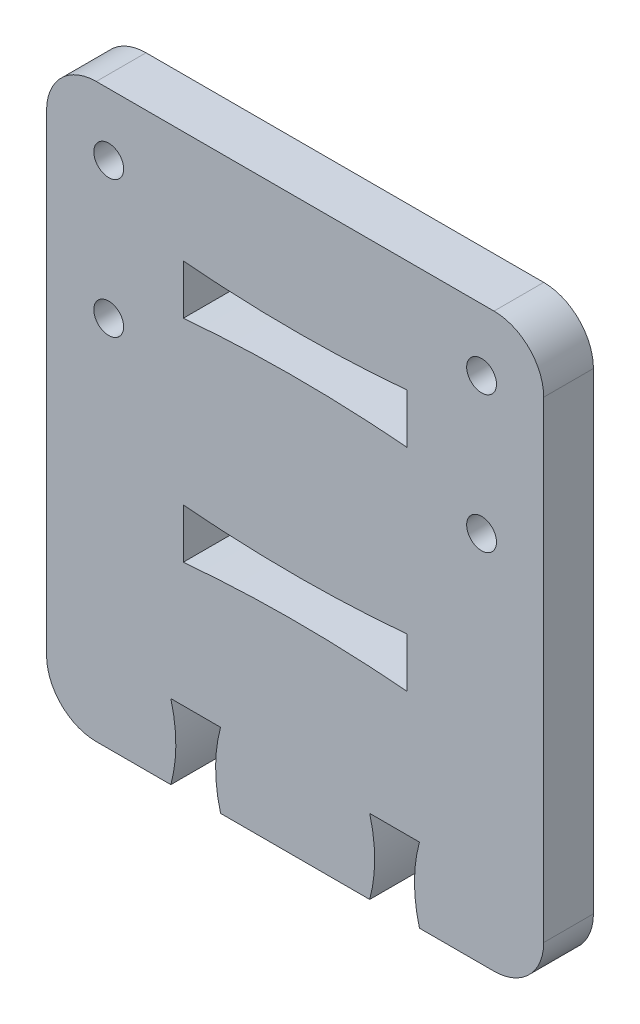
ISO-10303-21;
HEADER;
FILE_DESCRIPTION(('STEP AP214'),'2;1');
FILE_NAME('part.step','',(''),(''),'','','');
FILE_SCHEMA(('AUTOMOTIVE_DESIGN { 1 0 10303 214 1 1 1 1 }'));
ENDSEC;
DATA;
#1=APPLICATION_CONTEXT('core data for automotive mechanical design processes');
#2=APPLICATION_PROTOCOL_DEFINITION('international standard','automotive_design',2000,#1);
#3=PRODUCT_CONTEXT('',#1,'mechanical');
#4=PRODUCT('Part','Part','',(#3));
#5=PRODUCT_RELATED_PRODUCT_CATEGORY('part','',(#4));
#6=PRODUCT_DEFINITION_FORMATION('','',#4);
#7=PRODUCT_DEFINITION_CONTEXT('part definition',#1,'design');
#8=PRODUCT_DEFINITION('design','',#6,#7);
#9=PRODUCT_DEFINITION_SHAPE('','',#8);
#10=(LENGTH_UNIT() NAMED_UNIT(*) SI_UNIT(.MILLI.,.METRE.));
#11=(NAMED_UNIT(*) PLANE_ANGLE_UNIT() SI_UNIT($,.RADIAN.));
#12=(NAMED_UNIT(*) SI_UNIT($,.STERADIAN.) SOLID_ANGLE_UNIT());
#13=UNCERTAINTY_MEASURE_WITH_UNIT(LENGTH_MEASURE(1.E-05),#10,'distance_accuracy_value','');
#14=(GEOMETRIC_REPRESENTATION_CONTEXT(3) GLOBAL_UNCERTAINTY_ASSIGNED_CONTEXT((#13)) GLOBAL_UNIT_ASSIGNED_CONTEXT((#10,
#11,#12)) REPRESENTATION_CONTEXT('',''));
#15=CARTESIAN_POINT('',(0.,0.,0.));
#16=DIRECTION('',(0.,0.,1.));
#17=DIRECTION('',(1.,0.,0.));
#18=AXIS2_PLACEMENT_3D('',#15,#16,#17);
#19=CARTESIAN_POINT('',(14.8,1.5,2.));
#20=DIRECTION('',(0.,0.,-1.));
#21=DIRECTION('',(-1.,0.,0.));
#22=AXIS2_PLACEMENT_3D('',#19,#20,#21);
#23=PLANE('',#22);
#24=CARTESIAN_POINT('',(2.5,15.,2.));
#25=DIRECTION('',(0.,0.,1.));
#26=DIRECTION('',(1.,0.,0.));
#27=AXIS2_PLACEMENT_3D('',#24,#25,#26);
#28=CIRCLE('',#27,0.6);
#29=CARTESIAN_POINT('',(3.1,15.,2.));
#30=VERTEX_POINT('',#29);
#31=EDGE_CURVE('E811',#30,#30,#28,.T.);
#32=ORIENTED_EDGE('',*,*,#31,.F.);
#33=EDGE_LOOP('',(#32));
#34=FACE_BOUND('',#33,.T.);
#35=CARTESIAN_POINT('',(14.5,18.5,2.));
#36=CARTESIAN_POINT('',(10.,18.1,2.));
#37=CARTESIAN_POINT('',(5.5,18.5,2.));
#38=B_SPLINE_CURVE_WITH_KNOTS('',2,(#35,#36,#37),.UNSPECIFIED.,.F.,.F.,(3,3),(0.,1.),.UNSPECIFIED.);
#39=CARTESIAN_POINT('',(14.5,18.5,2.));
#40=VERTEX_POINT('',#39);
#41=CARTESIAN_POINT('',(5.5,18.5,2.));
#42=VERTEX_POINT('',#41);
#43=EDGE_CURVE('E294',#40,#42,#38,.T.);
#44=ORIENTED_EDGE('',*,*,#43,.F.);
#45=DIRECTION('',(0.,1.,0.));
#46=VECTOR('',#45,1.);
#47=CARTESIAN_POINT('',(14.5,16.5,2.));
#48=LINE('',#47,#46);
#49=CARTESIAN_POINT('',(14.5,16.5,2.));
#50=VERTEX_POINT('',#49);
#51=EDGE_CURVE('E265',#50,#40,#48,.T.);
#52=ORIENTED_EDGE('',*,*,#51,.F.);
#53=CARTESIAN_POINT('',(5.5,16.5,2.));
#54=CARTESIAN_POINT('',(10.,16.9,2.));
#55=CARTESIAN_POINT('',(14.5,16.5,2.));
#56=B_SPLINE_CURVE_WITH_KNOTS('',2,(#53,#54,#55),.UNSPECIFIED.,.F.,.F.,(3,3),(0.,1.),.UNSPECIFIED.);
#57=CARTESIAN_POINT('',(5.5,16.5,2.));
#58=VERTEX_POINT('',#57);
#59=EDGE_CURVE('E258',#58,#50,#56,.T.);
#60=ORIENTED_EDGE('',*,*,#59,.F.);
#61=DIRECTION('',(0.,-1.,0.));
#62=VECTOR('',#61,1.);
#63=CARTESIAN_POINT('',(5.5,16.5,2.));
#64=LINE('',#63,#62);
#65=EDGE_CURVE('E266',#42,#58,#64,.T.);
#66=ORIENTED_EDGE('',*,*,#65,.F.);
#67=EDGE_LOOP('',(#44,#52,#60,#66));
#68=FACE_BOUND('',#67,.T.);
#69=CARTESIAN_POINT('',(17.5,20.5,2.));
#70=DIRECTION('',(0.,0.,1.));
#71=DIRECTION('',(-1.,0.,0.));
#72=AXIS2_PLACEMENT_3D('',#69,#70,#71);
#73=CIRCLE('',#72,0.600000000000003);
#74=CARTESIAN_POINT('',(16.9,20.5,2.));
#75=VERTEX_POINT('',#74);
#76=EDGE_CURVE('E311',#75,#75,#73,.T.);
#77=ORIENTED_EDGE('',*,*,#76,.F.);
#78=EDGE_LOOP('',(#77));
#79=FACE_BOUND('',#78,.T.);
#80=DIRECTION('',(0.,-1.,0.));
#81=VECTOR('',#80,1.);
#82=CARTESIAN_POINT('',(0.,0.,2.));
#83=LINE('',#82,#81);
#84=CARTESIAN_POINT('',(0.,21.,2.));
#85=VERTEX_POINT('',#84);
#86=CARTESIAN_POINT('',(0.,2.,2.));
#87=VERTEX_POINT('',#86);
#88=EDGE_CURVE('E513',#85,#87,#83,.T.);
#89=ORIENTED_EDGE('',*,*,#88,.T.);
#90=CARTESIAN_POINT('',(2.,2.,2.));
#91=DIRECTION('',(0.,0.,-1.));
#92=DIRECTION('',(-1.,0.,0.));
#93=AXIS2_PLACEMENT_3D('',#90,#91,#92);
#94=CIRCLE('',#93,2.);
#95=CARTESIAN_POINT('',(2.,0.,2.));
#96=VERTEX_POINT('',#95);
#97=EDGE_CURVE('E482',#87,#96,#94,.F.);
#98=ORIENTED_EDGE('',*,*,#97,.T.);
#99=DIRECTION('',(1.,0.,0.));
#100=VECTOR('',#99,1.);
#101=CARTESIAN_POINT('',(5.,0.,2.));
#102=LINE('',#101,#100);
#103=CARTESIAN_POINT('',(5.,0.,2.));
#104=VERTEX_POINT('',#103);
#105=EDGE_CURVE('E515',#96,#104,#102,.T.);
#106=ORIENTED_EDGE('',*,*,#105,.T.);
#107=CARTESIAN_POINT('',(5.,0.,2.));
#108=CARTESIAN_POINT('',(5.4,1.5,2.));
#109=CARTESIAN_POINT('',(5.,3.,2.));
#110=B_SPLINE_CURVE_WITH_KNOTS('',2,(#107,#108,#109),.UNSPECIFIED.,.F.,.F.,(3,3),(0.,1.),.UNSPECIFIED.);
#111=CARTESIAN_POINT('',(5.,3.,2.));
#112=VERTEX_POINT('',#111);
#113=EDGE_CURVE('E519',#104,#112,#110,.T.);
#114=ORIENTED_EDGE('',*,*,#113,.T.);
#115=DIRECTION('',(1.,0.,0.));
#116=VECTOR('',#115,1.);
#117=CARTESIAN_POINT('',(5.,3.,2.));
#118=LINE('',#117,#116);
#119=CARTESIAN_POINT('',(7.,3.,2.));
#120=VERTEX_POINT('',#119);
#121=EDGE_CURVE('E524',#112,#120,#118,.T.);
#122=ORIENTED_EDGE('',*,*,#121,.T.);
#123=CARTESIAN_POINT('',(7.,3.,2.));
#124=CARTESIAN_POINT('',(6.6,1.5,2.));
#125=CARTESIAN_POINT('',(7.,0.,2.));
#126=B_SPLINE_CURVE_WITH_KNOTS('',2,(#123,#124,#125),.UNSPECIFIED.,.F.,.F.,(3,3),(0.,1.),.UNSPECIFIED.);
#127=CARTESIAN_POINT('',(7.,0.,2.));
#128=VERTEX_POINT('',#127);
#129=EDGE_CURVE('E755',#120,#128,#126,.T.);
#130=ORIENTED_EDGE('',*,*,#129,.T.);
#131=DIRECTION('',(1.,0.,0.));
#132=VECTOR('',#131,1.);
#133=CARTESIAN_POINT('',(13.,0.,2.));
#134=LINE('',#133,#132);
#135=CARTESIAN_POINT('',(13.,0.,2.));
#136=VERTEX_POINT('',#135);
#137=EDGE_CURVE('E385',#128,#136,#134,.T.);
#138=ORIENTED_EDGE('',*,*,#137,.T.);
#139=CARTESIAN_POINT('',(13.,0.,2.));
#140=CARTESIAN_POINT('',(13.4,1.5,2.));
#141=CARTESIAN_POINT('',(13.,3.,2.));
#142=B_SPLINE_CURVE_WITH_KNOTS('',2,(#139,#140,#141),.UNSPECIFIED.,.F.,.F.,(3,3),(0.,1.),.UNSPECIFIED.);
#143=CARTESIAN_POINT('',(13.,3.,2.));
#144=VERTEX_POINT('',#143);
#145=EDGE_CURVE('E378',#136,#144,#142,.T.);
#146=ORIENTED_EDGE('',*,*,#145,.T.);
#147=DIRECTION('',(1.,0.,0.));
#148=VECTOR('',#147,1.);
#149=CARTESIAN_POINT('',(15.,3.,2.));
#150=LINE('',#149,#148);
#151=CARTESIAN_POINT('',(15.,3.,2.));
#152=VERTEX_POINT('',#151);
#153=EDGE_CURVE('E384',#144,#152,#150,.T.);
#154=ORIENTED_EDGE('',*,*,#153,.T.);
#155=CARTESIAN_POINT('',(15.,3.,2.));
#156=CARTESIAN_POINT('',(14.6,1.5,2.));
#157=CARTESIAN_POINT('',(15.,0.,2.));
#158=B_SPLINE_CURVE_WITH_KNOTS('',2,(#155,#156,#157),.UNSPECIFIED.,.F.,.F.,(3,3),(0.,1.),.UNSPECIFIED.);
#159=CARTESIAN_POINT('',(15.,0.,2.));
#160=VERTEX_POINT('',#159);
#161=EDGE_CURVE('E317',#152,#160,#158,.T.);
#162=ORIENTED_EDGE('',*,*,#161,.T.);
#163=DIRECTION('',(1.,0.,0.));
#164=VECTOR('',#163,1.);
#165=CARTESIAN_POINT('',(15.,0.,2.));
#166=LINE('',#165,#164);
#167=CARTESIAN_POINT('',(18.,0.,2.));
#168=VERTEX_POINT('',#167);
#169=EDGE_CURVE('E323',#160,#168,#166,.T.);
#170=ORIENTED_EDGE('',*,*,#169,.T.);
#171=CARTESIAN_POINT('',(18.,2.,2.));
#172=DIRECTION('',(0.,0.,-1.));
#173=DIRECTION('',(-1.,0.,0.));
#174=AXIS2_PLACEMENT_3D('',#171,#172,#173);
#175=CIRCLE('',#174,2.);
#176=CARTESIAN_POINT('',(20.,2.,2.));
#177=VERTEX_POINT('',#176);
#178=EDGE_CURVE('E480',#168,#177,#175,.F.);
#179=ORIENTED_EDGE('',*,*,#178,.T.);
#180=DIRECTION('',(0.,1.,0.));
#181=VECTOR('',#180,1.);
#182=CARTESIAN_POINT('',(20.,0.,2.));
#183=LINE('',#182,#181);
#184=CARTESIAN_POINT('',(20.,21.,2.));
#185=VERTEX_POINT('',#184);
#186=EDGE_CURVE('E499',#177,#185,#183,.T.);
#187=ORIENTED_EDGE('',*,*,#186,.T.);
#188=CARTESIAN_POINT('',(18.,21.,2.));
#189=DIRECTION('',(0.,0.,-1.));
#190=DIRECTION('',(-1.,0.,0.));
#191=AXIS2_PLACEMENT_3D('',#188,#189,#190);
#192=CIRCLE('',#191,2.);
#193=CARTESIAN_POINT('',(18.,23.,2.));
#194=VERTEX_POINT('',#193);
#195=EDGE_CURVE('E53',#185,#194,#192,.F.);
#196=ORIENTED_EDGE('',*,*,#195,.T.);
#197=DIRECTION('',(-1.,0.,0.));
#198=VECTOR('',#197,1.);
#199=CARTESIAN_POINT('',(0.,23.,2.));
#200=LINE('',#199,#198);
#201=CARTESIAN_POINT('',(2.,23.,2.));
#202=VERTEX_POINT('',#201);
#203=EDGE_CURVE('E511',#194,#202,#200,.T.);
#204=ORIENTED_EDGE('',*,*,#203,.T.);
#205=CARTESIAN_POINT('',(2.,21.,2.));
#206=DIRECTION('',(0.,0.,-1.));
#207=DIRECTION('',(-1.,0.,0.));
#208=AXIS2_PLACEMENT_3D('',#205,#206,#207);
#209=CIRCLE('',#208,2.);
#210=EDGE_CURVE('E477',#202,#85,#209,.F.);
#211=ORIENTED_EDGE('',*,*,#210,.T.);
#212=EDGE_LOOP('',(#89,#98,#106,#114,#122,#130,#138,#146,#154,#162,#170,#179,#187,#196,#204,#211));
#213=FACE_BOUND('',#212,.T.);
#214=CARTESIAN_POINT('',(17.5,15.,2.));
#215=DIRECTION('',(0.,0.,1.));
#216=DIRECTION('',(-1.,0.,0.));
#217=AXIS2_PLACEMENT_3D('',#214,#215,#216);
#218=CIRCLE('',#217,0.600000000000004);
#219=CARTESIAN_POINT('',(16.9,15.,2.));
#220=VERTEX_POINT('',#219);
#221=EDGE_CURVE('E305',#220,#220,#218,.T.);
#222=ORIENTED_EDGE('',*,*,#221,.F.);
#223=EDGE_LOOP('',(#222));
#224=FACE_BOUND('',#223,.T.);
#225=CARTESIAN_POINT('',(14.5,10.,2.));
#226=CARTESIAN_POINT('',(10.,9.6,2.));
#227=CARTESIAN_POINT('',(5.5,10.,2.));
#228=B_SPLINE_CURVE_WITH_KNOTS('',2,(#225,#226,#227),.UNSPECIFIED.,.F.,.F.,(3,3),(0.,1.),.UNSPECIFIED.);
#229=CARTESIAN_POINT('',(14.5,10.,2.));
#230=VERTEX_POINT('',#229);
#231=CARTESIAN_POINT('',(5.5,10.,2.));
#232=VERTEX_POINT('',#231);
#233=EDGE_CURVE('E195',#230,#232,#228,.T.);
#234=ORIENTED_EDGE('',*,*,#233,.F.);
#235=DIRECTION('',(0.,1.,0.));
#236=VECTOR('',#235,1.);
#237=CARTESIAN_POINT('',(14.5,8.,2.));
#238=LINE('',#237,#236);
#239=CARTESIAN_POINT('',(14.5,8.,2.));
#240=VERTEX_POINT('',#239);
#241=EDGE_CURVE('E221',#240,#230,#238,.T.);
#242=ORIENTED_EDGE('',*,*,#241,.F.);
#243=CARTESIAN_POINT('',(5.5,8.,2.));
#244=CARTESIAN_POINT('',(10.,8.40000000000001,2.));
#245=CARTESIAN_POINT('',(14.5,8.,2.));
#246=B_SPLINE_CURVE_WITH_KNOTS('',2,(#243,#244,#245),.UNSPECIFIED.,.F.,.F.,(3,3),(0.,1.),.UNSPECIFIED.);
#247=CARTESIAN_POINT('',(5.5,8.,2.));
#248=VERTEX_POINT('',#247);
#249=EDGE_CURVE('E219',#248,#240,#246,.T.);
#250=ORIENTED_EDGE('',*,*,#249,.F.);
#251=DIRECTION('',(0.,-1.,0.));
#252=VECTOR('',#251,1.);
#253=CARTESIAN_POINT('',(5.5,8.,2.));
#254=LINE('',#253,#252);
#255=EDGE_CURVE('E205',#232,#248,#254,.T.);
#256=ORIENTED_EDGE('',*,*,#255,.F.);
#257=EDGE_LOOP('',(#234,#242,#250,#256));
#258=FACE_BOUND('',#257,.T.);
#259=CARTESIAN_POINT('',(2.5,20.5,2.));
#260=DIRECTION('',(0.,0.,1.));
#261=DIRECTION('',(1.,0.,0.));
#262=AXIS2_PLACEMENT_3D('',#259,#260,#261);
#263=CIRCLE('',#262,0.6);
#264=CARTESIAN_POINT('',(3.1,20.5,2.));
#265=VERTEX_POINT('',#264);
#266=EDGE_CURVE('E820',#265,#265,#263,.T.);
#267=ORIENTED_EDGE('',*,*,#266,.F.);
#268=EDGE_LOOP('',(#267));
#269=FACE_BOUND('',#268,.T.);
#270=ADVANCED_FACE('F32',(#34,#68,#79,#213,#224,#258,#269),#23,.F.);
#271=CARTESIAN_POINT('',(14.8,1.5,0.));
#272=DIRECTION('',(0.,0.,-1.));
#273=DIRECTION('',(-1.,0.,0.));
#274=AXIS2_PLACEMENT_3D('',#271,#272,#273);
#275=PLANE('',#274);
#276=CARTESIAN_POINT('',(2.5,15.,0.));
#277=DIRECTION('',(0.,0.,1.));
#278=DIRECTION('',(1.,0.,0.));
#279=AXIS2_PLACEMENT_3D('',#276,#277,#278);
#280=CIRCLE('',#279,0.6);
#281=CARTESIAN_POINT('',(3.1,15.,0.));
#282=VERTEX_POINT('',#281);
#283=EDGE_CURVE('E817',#282,#282,#280,.T.);
#284=ORIENTED_EDGE('',*,*,#283,.T.);
#285=EDGE_LOOP('',(#284));
#286=FACE_BOUND('',#285,.T.);
#287=DIRECTION('',(0.,1.,0.));
#288=VECTOR('',#287,1.);
#289=CARTESIAN_POINT('',(14.5,16.5,0.));
#290=LINE('',#289,#288);
#291=CARTESIAN_POINT('',(14.5,16.5,0.));
#292=VERTEX_POINT('',#291);
#293=CARTESIAN_POINT('',(14.5,18.5,0.));
#294=VERTEX_POINT('',#293);
#295=EDGE_CURVE('E288',#292,#294,#290,.T.);
#296=ORIENTED_EDGE('',*,*,#295,.T.);
#297=CARTESIAN_POINT('',(14.5,18.5,0.));
#298=CARTESIAN_POINT('',(10.,18.1,0.));
#299=CARTESIAN_POINT('',(5.5,18.5,0.));
#300=B_SPLINE_CURVE_WITH_KNOTS('',2,(#297,#298,#299),.UNSPECIFIED.,.F.,.F.,(3,3),(0.,1.),.UNSPECIFIED.);
#301=CARTESIAN_POINT('',(5.5,18.5,0.));
#302=VERTEX_POINT('',#301);
#303=EDGE_CURVE('E213',#294,#302,#300,.T.);
#304=ORIENTED_EDGE('',*,*,#303,.T.);
#305=DIRECTION('',(0.,-1.,0.));
#306=VECTOR('',#305,1.);
#307=CARTESIAN_POINT('',(5.5,16.5,0.));
#308=LINE('',#307,#306);
#309=CARTESIAN_POINT('',(5.5,16.5,0.));
#310=VERTEX_POINT('',#309);
#311=EDGE_CURVE('E277',#302,#310,#308,.T.);
#312=ORIENTED_EDGE('',*,*,#311,.T.);
#313=CARTESIAN_POINT('',(5.5,16.5,0.));
#314=CARTESIAN_POINT('',(10.,16.9,0.));
#315=CARTESIAN_POINT('',(14.5,16.5,0.));
#316=B_SPLINE_CURVE_WITH_KNOTS('',2,(#313,#314,#315),.UNSPECIFIED.,.F.,.F.,(3,3),(0.,1.),.UNSPECIFIED.);
#317=EDGE_CURVE('E283',#310,#292,#316,.T.);
#318=ORIENTED_EDGE('',*,*,#317,.T.);
#319=EDGE_LOOP('',(#296,#304,#312,#318));
#320=FACE_BOUND('',#319,.T.);
#321=CARTESIAN_POINT('',(17.5,20.5,0.));
#322=DIRECTION('',(0.,0.,1.));
#323=DIRECTION('',(-1.,0.,0.));
#324=AXIS2_PLACEMENT_3D('',#321,#322,#323);
#325=CIRCLE('',#324,0.600000000000003);
#326=CARTESIAN_POINT('',(16.9,20.5,0.));
#327=VERTEX_POINT('',#326);
#328=EDGE_CURVE('E308',#327,#327,#325,.T.);
#329=ORIENTED_EDGE('',*,*,#328,.T.);
#330=EDGE_LOOP('',(#329));
#331=FACE_BOUND('',#330,.T.);
#332=DIRECTION('',(1.,0.,0.));
#333=VECTOR('',#332,1.);
#334=CARTESIAN_POINT('',(5.,0.,0.));
#335=LINE('',#334,#333);
#336=CARTESIAN_POINT('',(2.,0.,0.));
#337=VERTEX_POINT('',#336);
#338=CARTESIAN_POINT('',(5.,0.,0.));
#339=VERTEX_POINT('',#338);
#340=EDGE_CURVE('E410',#337,#339,#335,.T.);
#341=ORIENTED_EDGE('',*,*,#340,.F.);
#342=CARTESIAN_POINT('',(2.,2.,0.));
#343=DIRECTION('',(0.,0.,-1.));
#344=DIRECTION('',(-1.,0.,0.));
#345=AXIS2_PLACEMENT_3D('',#342,#343,#344);
#346=CIRCLE('',#345,2.);
#347=CARTESIAN_POINT('',(0.,2.,0.));
#348=VERTEX_POINT('',#347);
#349=EDGE_CURVE('E470',#337,#348,#346,.T.);
#350=ORIENTED_EDGE('',*,*,#349,.T.);
#351=DIRECTION('',(0.,-1.,0.));
#352=VECTOR('',#351,1.);
#353=CARTESIAN_POINT('',(0.,0.,0.));
#354=LINE('',#353,#352);
#355=CARTESIAN_POINT('',(0.,21.,0.));
#356=VERTEX_POINT('',#355);
#357=EDGE_CURVE('E407',#356,#348,#354,.T.);
#358=ORIENTED_EDGE('',*,*,#357,.F.);
#359=CARTESIAN_POINT('',(2.,21.,0.));
#360=DIRECTION('',(0.,0.,-1.));
#361=DIRECTION('',(-1.,0.,0.));
#362=AXIS2_PLACEMENT_3D('',#359,#360,#361);
#363=CIRCLE('',#362,2.);
#364=CARTESIAN_POINT('',(2.,23.,0.));
#365=VERTEX_POINT('',#364);
#366=EDGE_CURVE('E464',#356,#365,#363,.T.);
#367=ORIENTED_EDGE('',*,*,#366,.T.);
#368=DIRECTION('',(-1.,0.,0.));
#369=VECTOR('',#368,1.);
#370=CARTESIAN_POINT('',(0.,23.,0.));
#371=LINE('',#370,#369);
#372=CARTESIAN_POINT('',(18.,23.,0.));
#373=VERTEX_POINT('',#372);
#374=EDGE_CURVE('E405',#373,#365,#371,.T.);
#375=ORIENTED_EDGE('',*,*,#374,.F.);
#376=CARTESIAN_POINT('',(18.,21.,0.));
#377=DIRECTION('',(0.,0.,-1.));
#378=DIRECTION('',(-1.,0.,0.));
#379=AXIS2_PLACEMENT_3D('',#376,#377,#378);
#380=CIRCLE('',#379,2.);
#381=CARTESIAN_POINT('',(20.,21.,0.));
#382=VERTEX_POINT('',#381);
#383=EDGE_CURVE('E466',#373,#382,#380,.T.);
#384=ORIENTED_EDGE('',*,*,#383,.T.);
#385=DIRECTION('',(0.,1.,0.));
#386=VECTOR('',#385,1.);
#387=CARTESIAN_POINT('',(20.,0.,0.));
#388=LINE('',#387,#386);
#389=CARTESIAN_POINT('',(20.,2.,0.));
#390=VERTEX_POINT('',#389);
#391=EDGE_CURVE('E402',#390,#382,#388,.T.);
#392=ORIENTED_EDGE('',*,*,#391,.F.);
#393=CARTESIAN_POINT('',(18.,2.,0.));
#394=DIRECTION('',(0.,0.,-1.));
#395=DIRECTION('',(-1.,0.,0.));
#396=AXIS2_PLACEMENT_3D('',#393,#394,#395);
#397=CIRCLE('',#396,2.);
#398=CARTESIAN_POINT('',(18.,0.,0.));
#399=VERTEX_POINT('',#398);
#400=EDGE_CURVE('E468',#390,#399,#397,.T.);
#401=ORIENTED_EDGE('',*,*,#400,.T.);
#402=DIRECTION('',(1.,0.,0.));
#403=VECTOR('',#402,1.);
#404=CARTESIAN_POINT('',(15.,0.,0.));
#405=LINE('',#404,#403);
#406=CARTESIAN_POINT('',(15.,0.,0.));
#407=VERTEX_POINT('',#406);
#408=EDGE_CURVE('E396',#407,#399,#405,.T.);
#409=ORIENTED_EDGE('',*,*,#408,.F.);
#410=CARTESIAN_POINT('',(15.,3.,0.));
#411=CARTESIAN_POINT('',(14.6,1.5,0.));
#412=CARTESIAN_POINT('',(15.,0.,0.));
#413=B_SPLINE_CURVE_WITH_KNOTS('',2,(#410,#411,#412),.UNSPECIFIED.,.F.,.F.,(3,3),(0.,1.),.UNSPECIFIED.);
#414=CARTESIAN_POINT('',(15.,3.,0.));
#415=VERTEX_POINT('',#414);
#416=EDGE_CURVE('E314',#415,#407,#413,.T.);
#417=ORIENTED_EDGE('',*,*,#416,.F.);
#418=DIRECTION('',(1.,0.,0.));
#419=VECTOR('',#418,1.);
#420=CARTESIAN_POINT('',(15.,3.,0.));
#421=LINE('',#420,#419);
#422=CARTESIAN_POINT('',(13.,3.,0.));
#423=VERTEX_POINT('',#422);
#424=EDGE_CURVE('E324',#423,#415,#421,.T.);
#425=ORIENTED_EDGE('',*,*,#424,.F.);
#426=CARTESIAN_POINT('',(13.,0.,0.));
#427=CARTESIAN_POINT('',(13.4,1.5,0.));
#428=CARTESIAN_POINT('',(13.,3.,0.));
#429=B_SPLINE_CURVE_WITH_KNOTS('',2,(#426,#427,#428),.UNSPECIFIED.,.F.,.F.,(3,3),(0.,1.),.UNSPECIFIED.);
#430=CARTESIAN_POINT('',(13.,0.,0.));
#431=VERTEX_POINT('',#430);
#432=EDGE_CURVE('E430',#431,#423,#429,.T.);
#433=ORIENTED_EDGE('',*,*,#432,.F.);
#434=DIRECTION('',(1.,0.,0.));
#435=VECTOR('',#434,1.);
#436=CARTESIAN_POINT('',(13.,0.,0.));
#437=LINE('',#436,#435);
#438=CARTESIAN_POINT('',(7.,0.,0.));
#439=VERTEX_POINT('',#438);
#440=EDGE_CURVE('E425',#439,#431,#437,.T.);
#441=ORIENTED_EDGE('',*,*,#440,.F.);
#442=CARTESIAN_POINT('',(7.,3.,0.));
#443=CARTESIAN_POINT('',(6.6,1.5,0.));
#444=CARTESIAN_POINT('',(7.,0.,0.));
#445=B_SPLINE_CURVE_WITH_KNOTS('',2,(#442,#443,#444),.UNSPECIFIED.,.F.,.F.,(3,3),(0.,1.),.UNSPECIFIED.);
#446=CARTESIAN_POINT('',(7.,3.,0.));
#447=VERTEX_POINT('',#446);
#448=EDGE_CURVE('E421',#447,#439,#445,.T.);
#449=ORIENTED_EDGE('',*,*,#448,.F.);
#450=DIRECTION('',(1.,0.,0.));
#451=VECTOR('',#450,1.);
#452=CARTESIAN_POINT('',(5.,3.,0.));
#453=LINE('',#452,#451);
#454=CARTESIAN_POINT('',(5.,3.,0.));
#455=VERTEX_POINT('',#454);
#456=EDGE_CURVE('E416',#455,#447,#453,.T.);
#457=ORIENTED_EDGE('',*,*,#456,.F.);
#458=CARTESIAN_POINT('',(5.,0.,0.));
#459=CARTESIAN_POINT('',(5.4,1.5,0.));
#460=CARTESIAN_POINT('',(5.,3.,0.));
#461=B_SPLINE_CURVE_WITH_KNOTS('',2,(#458,#459,#460),.UNSPECIFIED.,.F.,.F.,(3,3),(0.,1.),.UNSPECIFIED.);
#462=EDGE_CURVE('E412',#339,#455,#461,.T.);
#463=ORIENTED_EDGE('',*,*,#462,.F.);
#464=EDGE_LOOP('',(#341,#350,#358,#367,#375,#384,#392,#401,#409,#417,#425,#433,#441,#449,#457,#463));
#465=FACE_BOUND('',#464,.T.);
#466=CARTESIAN_POINT('',(17.5,15.,0.));
#467=DIRECTION('',(0.,0.,1.));
#468=DIRECTION('',(-1.,0.,0.));
#469=AXIS2_PLACEMENT_3D('',#466,#467,#468);
#470=CIRCLE('',#469,0.600000000000004);
#471=CARTESIAN_POINT('',(16.9,15.,0.));
#472=VERTEX_POINT('',#471);
#473=EDGE_CURVE('E304',#472,#472,#470,.T.);
#474=ORIENTED_EDGE('',*,*,#473,.T.);
#475=EDGE_LOOP('',(#474));
#476=FACE_BOUND('',#475,.T.);
#477=DIRECTION('',(0.,1.,0.));
#478=VECTOR('',#477,1.);
#479=CARTESIAN_POINT('',(14.5,8.,0.));
#480=LINE('',#479,#478);
#481=CARTESIAN_POINT('',(14.5,8.,0.));
#482=VERTEX_POINT('',#481);
#483=CARTESIAN_POINT('',(14.5,10.,0.));
#484=VERTEX_POINT('',#483);
#485=EDGE_CURVE('E206',#482,#484,#480,.T.);
#486=ORIENTED_EDGE('',*,*,#485,.T.);
#487=CARTESIAN_POINT('',(14.5,10.,0.));
#488=CARTESIAN_POINT('',(10.,9.6,0.));
#489=CARTESIAN_POINT('',(5.5,10.,0.));
#490=B_SPLINE_CURVE_WITH_KNOTS('',2,(#487,#488,#489),.UNSPECIFIED.,.F.,.F.,(3,3),(0.,1.),.UNSPECIFIED.);
#491=CARTESIAN_POINT('',(5.5,10.,0.));
#492=VERTEX_POINT('',#491);
#493=EDGE_CURVE('E808',#484,#492,#490,.T.);
#494=ORIENTED_EDGE('',*,*,#493,.T.);
#495=DIRECTION('',(0.,-1.,0.));
#496=VECTOR('',#495,1.);
#497=CARTESIAN_POINT('',(5.5,8.,0.));
#498=LINE('',#497,#496);
#499=CARTESIAN_POINT('',(5.5,8.,0.));
#500=VERTEX_POINT('',#499);
#501=EDGE_CURVE('E212',#492,#500,#498,.T.);
#502=ORIENTED_EDGE('',*,*,#501,.T.);
#503=CARTESIAN_POINT('',(5.5,8.,0.));
#504=CARTESIAN_POINT('',(10.,8.40000000000001,0.));
#505=CARTESIAN_POINT('',(14.5,8.,0.));
#506=B_SPLINE_CURVE_WITH_KNOTS('',2,(#503,#504,#505),.UNSPECIFIED.,.F.,.F.,(3,3),(0.,1.),.UNSPECIFIED.);
#507=EDGE_CURVE('E800',#500,#482,#506,.T.);
#508=ORIENTED_EDGE('',*,*,#507,.T.);
#509=EDGE_LOOP('',(#486,#494,#502,#508));
#510=FACE_BOUND('',#509,.T.);
#511=CARTESIAN_POINT('',(2.5,20.5,0.));
#512=DIRECTION('',(0.,0.,1.));
#513=DIRECTION('',(1.,0.,0.));
#514=AXIS2_PLACEMENT_3D('',#511,#512,#513);
#515=CIRCLE('',#514,0.6);
#516=CARTESIAN_POINT('',(3.1,20.5,0.));
#517=VERTEX_POINT('',#516);
#518=EDGE_CURVE('E822',#517,#517,#515,.T.);
#519=ORIENTED_EDGE('',*,*,#518,.T.);
#520=EDGE_LOOP('',(#519));
#521=FACE_BOUND('',#520,.T.);
#522=ADVANCED_FACE('F335',(#286,#320,#331,#465,#476,#510,#521),#275,.T.);
#523=DIRECTION('',(0.,0.,-1.));
#524=VECTOR('',#523,1.);
#525=SURFACE_OF_LINEAR_EXTRUSION('',#158,#524);
#526=ORIENTED_EDGE('',*,*,#416,.T.);
#527=DIRECTION('',(0.,0.,-1.));
#528=VECTOR('',#527,1.);
#529=CARTESIAN_POINT('',(15.,0.,2.));
#530=LINE('',#529,#528);
#531=EDGE_CURVE('E458',#160,#407,#530,.T.);
#532=ORIENTED_EDGE('',*,*,#531,.F.);
#533=ORIENTED_EDGE('',*,*,#161,.F.);
#534=DIRECTION('',(0.,0.,-1.));
#535=VECTOR('',#534,1.);
#536=CARTESIAN_POINT('',(15.,3.,2.));
#537=LINE('',#536,#535);
#538=EDGE_CURVE('E391',#152,#415,#537,.T.);
#539=ORIENTED_EDGE('',*,*,#538,.T.);
#540=EDGE_LOOP('',(#526,#532,#533,#539));
#541=FACE_BOUND('',#540,.T.);
#542=ADVANCED_FACE('F330',(#541),#525,.F.);
#543=CARTESIAN_POINT('',(15.,0.,2.));
#544=DIRECTION('',(0.,1.,0.));
#545=DIRECTION('',(0.,0.,1.));
#546=AXIS2_PLACEMENT_3D('',#543,#544,#545);
#547=PLANE('',#546);
#548=ORIENTED_EDGE('',*,*,#408,.T.);
#549=DIRECTION('',(0.,0.,-1.));
#550=VECTOR('',#549,1.);
#551=CARTESIAN_POINT('',(18.,0.,2.));
#552=LINE('',#551,#550);
#553=EDGE_CURVE('E489',#399,#168,#552,.F.);
#554=ORIENTED_EDGE('',*,*,#553,.T.);
#555=ORIENTED_EDGE('',*,*,#169,.F.);
#556=ORIENTED_EDGE('',*,*,#531,.T.);
#557=EDGE_LOOP('',(#548,#554,#555,#556));
#558=FACE_BOUND('',#557,.T.);
#559=ADVANCED_FACE('F334',(#558),#547,.F.);
#560=CARTESIAN_POINT('',(20.,0.,2.));
#561=DIRECTION('',(-1.,0.,0.));
#562=DIRECTION('',(0.,0.,1.));
#563=AXIS2_PLACEMENT_3D('',#560,#561,#562);
#564=PLANE('',#563);
#565=ORIENTED_EDGE('',*,*,#186,.F.);
#566=DIRECTION('',(0.,0.,-1.));
#567=VECTOR('',#566,1.);
#568=CARTESIAN_POINT('',(20.,2.,2.));
#569=LINE('',#568,#567);
#570=EDGE_CURVE('E486',#177,#390,#569,.T.);
#571=ORIENTED_EDGE('',*,*,#570,.T.);
#572=ORIENTED_EDGE('',*,*,#391,.T.);
#573=DIRECTION('',(0.,0.,-1.));
#574=VECTOR('',#573,1.);
#575=CARTESIAN_POINT('',(20.,21.,2.));
#576=LINE('',#575,#574);
#577=EDGE_CURVE('E484',#382,#185,#576,.F.);
#578=ORIENTED_EDGE('',*,*,#577,.T.);
#579=EDGE_LOOP('',(#565,#571,#572,#578));
#580=FACE_BOUND('',#579,.T.);
#581=ADVANCED_FACE('F503',(#580),#564,.F.);
#582=CARTESIAN_POINT('',(0.,23.,2.));
#583=DIRECTION('',(0.,-1.,0.));
#584=DIRECTION('',(0.,0.,-1.));
#585=AXIS2_PLACEMENT_3D('',#582,#583,#584);
#586=PLANE('',#585);
#587=ORIENTED_EDGE('',*,*,#203,.F.);
#588=DIRECTION('',(0.,0.,-1.));
#589=VECTOR('',#588,1.);
#590=CARTESIAN_POINT('',(18.,23.,2.));
#591=LINE('',#590,#589);
#592=EDGE_CURVE('E11',#194,#373,#591,.T.);
#593=ORIENTED_EDGE('',*,*,#592,.T.);
#594=ORIENTED_EDGE('',*,*,#374,.T.);
#595=DIRECTION('',(0.,0.,-1.));
#596=VECTOR('',#595,1.);
#597=CARTESIAN_POINT('',(2.,23.,2.));
#598=LINE('',#597,#596);
#599=EDGE_CURVE('E40',#365,#202,#598,.F.);
#600=ORIENTED_EDGE('',*,*,#599,.T.);
#601=EDGE_LOOP('',(#587,#593,#594,#600));
#602=FACE_BOUND('',#601,.T.);
#603=ADVANCED_FACE('F510',(#602),#586,.F.);
#604=CARTESIAN_POINT('',(0.,0.,2.));
#605=DIRECTION('',(1.,0.,0.));
#606=DIRECTION('',(0.,0.,-1.));
#607=AXIS2_PLACEMENT_3D('',#604,#605,#606);
#608=PLANE('',#607);
#609=ORIENTED_EDGE('',*,*,#357,.T.);
#610=DIRECTION('',(0.,0.,-1.));
#611=VECTOR('',#610,1.);
#612=CARTESIAN_POINT('',(0.,2.,2.));
#613=LINE('',#612,#611);
#614=EDGE_CURVE('E475',#348,#87,#613,.F.);
#615=ORIENTED_EDGE('',*,*,#614,.T.);
#616=ORIENTED_EDGE('',*,*,#88,.F.);
#617=DIRECTION('',(0.,0.,-1.));
#618=VECTOR('',#617,1.);
#619=CARTESIAN_POINT('',(0.,21.,2.));
#620=LINE('',#619,#618);
#621=EDGE_CURVE('E472',#85,#356,#620,.T.);
#622=ORIENTED_EDGE('',*,*,#621,.T.);
#623=EDGE_LOOP('',(#609,#615,#616,#622));
#624=FACE_BOUND('',#623,.T.);
#625=ADVANCED_FACE('F538',(#624),#608,.F.);
#626=CARTESIAN_POINT('',(5.,0.,2.));
#627=DIRECTION('',(0.,1.,0.));
#628=DIRECTION('',(0.,0.,1.));
#629=AXIS2_PLACEMENT_3D('',#626,#627,#628);
#630=PLANE('',#629);
#631=ORIENTED_EDGE('',*,*,#105,.F.);
#632=DIRECTION('',(0.,0.,-1.));
#633=VECTOR('',#632,1.);
#634=CARTESIAN_POINT('',(2.,0.,2.));
#635=LINE('',#634,#633);
#636=EDGE_CURVE('E461',#96,#337,#635,.T.);
#637=ORIENTED_EDGE('',*,*,#636,.T.);
#638=ORIENTED_EDGE('',*,*,#340,.T.);
#639=DIRECTION('',(0.,0.,-1.));
#640=VECTOR('',#639,1.);
#641=CARTESIAN_POINT('',(5.,0.,2.));
#642=LINE('',#641,#640);
#643=EDGE_CURVE('E455',#104,#339,#642,.T.);
#644=ORIENTED_EDGE('',*,*,#643,.F.);
#645=EDGE_LOOP('',(#631,#637,#638,#644));
#646=FACE_BOUND('',#645,.T.);
#647=ADVANCED_FACE('F534',(#646),#630,.F.);
#648=DIRECTION('',(0.,0.,-1.));
#649=VECTOR('',#648,1.);
#650=SURFACE_OF_LINEAR_EXTRUSION('',#110,#649);
#651=ORIENTED_EDGE('',*,*,#462,.T.);
#652=DIRECTION('',(0.,0.,-1.));
#653=VECTOR('',#652,1.);
#654=CARTESIAN_POINT('',(5.,3.,2.));
#655=LINE('',#654,#653);
#656=EDGE_CURVE('E452',#112,#455,#655,.T.);
#657=ORIENTED_EDGE('',*,*,#656,.F.);
#658=ORIENTED_EDGE('',*,*,#113,.F.);
#659=ORIENTED_EDGE('',*,*,#643,.T.);
#660=EDGE_LOOP('',(#651,#657,#658,#659));
#661=FACE_BOUND('',#660,.T.);
#662=ADVANCED_FACE('F529',(#661),#650,.F.);
#663=CARTESIAN_POINT('',(5.,3.,2.));
#664=DIRECTION('',(0.,1.,0.));
#665=DIRECTION('',(0.,0.,1.));
#666=AXIS2_PLACEMENT_3D('',#663,#664,#665);
#667=PLANE('',#666);
#668=ORIENTED_EDGE('',*,*,#456,.T.);
#669=DIRECTION('',(0.,0.,-1.));
#670=VECTOR('',#669,1.);
#671=CARTESIAN_POINT('',(7.,3.,2.));
#672=LINE('',#671,#670);
#673=EDGE_CURVE('E449',#120,#447,#672,.T.);
#674=ORIENTED_EDGE('',*,*,#673,.F.);
#675=ORIENTED_EDGE('',*,*,#121,.F.);
#676=ORIENTED_EDGE('',*,*,#656,.T.);
#677=EDGE_LOOP('',(#668,#674,#675,#676));
#678=FACE_BOUND('',#677,.T.);
#679=ADVANCED_FACE('F533',(#678),#667,.F.);
#680=DIRECTION('',(0.,0.,-1.));
#681=VECTOR('',#680,1.);
#682=SURFACE_OF_LINEAR_EXTRUSION('',#126,#681);
#683=ORIENTED_EDGE('',*,*,#448,.T.);
#684=DIRECTION('',(0.,0.,-1.));
#685=VECTOR('',#684,1.);
#686=CARTESIAN_POINT('',(7.,0.,2.));
#687=LINE('',#686,#685);
#688=EDGE_CURVE('E446',#128,#439,#687,.T.);
#689=ORIENTED_EDGE('',*,*,#688,.F.);
#690=ORIENTED_EDGE('',*,*,#129,.F.);
#691=ORIENTED_EDGE('',*,*,#673,.T.);
#692=EDGE_LOOP('',(#683,#689,#690,#691));
#693=FACE_BOUND('',#692,.T.);
#694=ADVANCED_FACE('F675',(#693),#682,.F.);
#695=CARTESIAN_POINT('',(13.,0.,2.));
#696=DIRECTION('',(0.,1.,0.));
#697=DIRECTION('',(0.,0.,1.));
#698=AXIS2_PLACEMENT_3D('',#695,#696,#697);
#699=PLANE('',#698);
#700=ORIENTED_EDGE('',*,*,#440,.T.);
#701=DIRECTION('',(0.,0.,-1.));
#702=VECTOR('',#701,1.);
#703=CARTESIAN_POINT('',(13.,0.,2.));
#704=LINE('',#703,#702);
#705=EDGE_CURVE('E443',#136,#431,#704,.T.);
#706=ORIENTED_EDGE('',*,*,#705,.F.);
#707=ORIENTED_EDGE('',*,*,#137,.F.);
#708=ORIENTED_EDGE('',*,*,#688,.T.);
#709=EDGE_LOOP('',(#700,#706,#707,#708));
#710=FACE_BOUND('',#709,.T.);
#711=ADVANCED_FACE('F375',(#710),#699,.F.);
#712=DIRECTION('',(0.,0.,-1.));
#713=VECTOR('',#712,1.);
#714=SURFACE_OF_LINEAR_EXTRUSION('',#142,#713);
#715=ORIENTED_EDGE('',*,*,#432,.T.);
#716=DIRECTION('',(0.,0.,-1.));
#717=VECTOR('',#716,1.);
#718=CARTESIAN_POINT('',(13.,3.,2.));
#719=LINE('',#718,#717);
#720=EDGE_CURVE('E440',#144,#423,#719,.T.);
#721=ORIENTED_EDGE('',*,*,#720,.F.);
#722=ORIENTED_EDGE('',*,*,#145,.F.);
#723=ORIENTED_EDGE('',*,*,#705,.T.);
#724=EDGE_LOOP('',(#715,#721,#722,#723));
#725=FACE_BOUND('',#724,.T.);
#726=ADVANCED_FACE('F370',(#725),#714,.F.);
#727=CARTESIAN_POINT('',(15.,3.,2.));
#728=DIRECTION('',(0.,1.,0.));
#729=DIRECTION('',(-1.,0.,0.));
#730=AXIS2_PLACEMENT_3D('',#727,#728,#729);
#731=PLANE('',#730);
#732=ORIENTED_EDGE('',*,*,#424,.T.);
#733=ORIENTED_EDGE('',*,*,#538,.F.);
#734=ORIENTED_EDGE('',*,*,#153,.F.);
#735=ORIENTED_EDGE('',*,*,#720,.T.);
#736=EDGE_LOOP('',(#732,#733,#734,#735));
#737=FACE_BOUND('',#736,.T.);
#738=ADVANCED_FACE('F367',(#737),#731,.F.);
#739=CARTESIAN_POINT('',(17.5,20.5,2.));
#740=DIRECTION('',(0.,0.,-1.));
#741=DIRECTION('',(-1.,0.,0.));
#742=AXIS2_PLACEMENT_3D('',#739,#740,#741);
#743=CYLINDRICAL_SURFACE('',#742,0.600000000000003);
#744=ORIENTED_EDGE('',*,*,#76,.T.);
#745=EDGE_LOOP('',(#744));
#746=FACE_BOUND('',#745,.T.);
#747=ORIENTED_EDGE('',*,*,#328,.F.);
#748=EDGE_LOOP('',(#747));
#749=FACE_BOUND('',#748,.T.);
#750=ADVANCED_FACE('F364',(#746,#749),#743,.F.);
#751=CARTESIAN_POINT('',(17.5,15.,2.));
#752=DIRECTION('',(0.,0.,-1.));
#753=DIRECTION('',(-1.,0.,0.));
#754=AXIS2_PLACEMENT_3D('',#751,#752,#753);
#755=CYLINDRICAL_SURFACE('',#754,0.600000000000004);
#756=ORIENTED_EDGE('',*,*,#221,.T.);
#757=EDGE_LOOP('',(#756));
#758=FACE_BOUND('',#757,.T.);
#759=ORIENTED_EDGE('',*,*,#473,.F.);
#760=EDGE_LOOP('',(#759));
#761=FACE_BOUND('',#760,.T.);
#762=ADVANCED_FACE('F638',(#758,#761),#755,.F.);
#763=DIRECTION('',(0.,0.,-1.));
#764=VECTOR('',#763,1.);
#765=SURFACE_OF_LINEAR_EXTRUSION('',#38,#764);
#766=ORIENTED_EDGE('',*,*,#303,.F.);
#767=DIRECTION('',(0.,0.,-1.));
#768=VECTOR('',#767,1.);
#769=CARTESIAN_POINT('',(14.5,18.5,2.));
#770=LINE('',#769,#768);
#771=EDGE_CURVE('E272',#40,#294,#770,.T.);
#772=ORIENTED_EDGE('',*,*,#771,.F.);
#773=ORIENTED_EDGE('',*,*,#43,.T.);
#774=DIRECTION('',(0.,0.,-1.));
#775=VECTOR('',#774,1.);
#776=CARTESIAN_POINT('',(5.5,18.5,2.));
#777=LINE('',#776,#775);
#778=EDGE_CURVE('E301',#42,#302,#777,.T.);
#779=ORIENTED_EDGE('',*,*,#778,.T.);
#780=EDGE_LOOP('',(#766,#772,#773,#779));
#781=FACE_BOUND('',#780,.T.);
#782=ADVANCED_FACE('F629',(#781),#765,.T.);
#783=CARTESIAN_POINT('',(5.5,16.5,2.));
#784=DIRECTION('',(1.,0.,0.));
#785=DIRECTION('',(0.,0.,-1.));
#786=AXIS2_PLACEMENT_3D('',#783,#784,#785);
#787=PLANE('',#786);
#788=ORIENTED_EDGE('',*,*,#311,.F.);
#789=ORIENTED_EDGE('',*,*,#778,.F.);
#790=ORIENTED_EDGE('',*,*,#65,.T.);
#791=DIRECTION('',(0.,0.,-1.));
#792=VECTOR('',#791,1.);
#793=CARTESIAN_POINT('',(5.5,16.5,2.));
#794=LINE('',#793,#792);
#795=EDGE_CURVE('E299',#58,#310,#794,.T.);
#796=ORIENTED_EDGE('',*,*,#795,.T.);
#797=EDGE_LOOP('',(#788,#789,#790,#796));
#798=FACE_BOUND('',#797,.T.);
#799=ADVANCED_FACE('F255',(#798),#787,.T.);
#800=DIRECTION('',(0.,0.,-1.));
#801=VECTOR('',#800,1.);
#802=SURFACE_OF_LINEAR_EXTRUSION('',#56,#801);
#803=ORIENTED_EDGE('',*,*,#317,.F.);
#804=ORIENTED_EDGE('',*,*,#795,.F.);
#805=ORIENTED_EDGE('',*,*,#59,.T.);
#806=DIRECTION('',(0.,0.,-1.));
#807=VECTOR('',#806,1.);
#808=CARTESIAN_POINT('',(14.5,16.5,2.));
#809=LINE('',#808,#807);
#810=EDGE_CURVE('E297',#50,#292,#809,.T.);
#811=ORIENTED_EDGE('',*,*,#810,.T.);
#812=EDGE_LOOP('',(#803,#804,#805,#811));
#813=FACE_BOUND('',#812,.T.);
#814=ADVANCED_FACE('F250',(#813),#802,.T.);
#815=CARTESIAN_POINT('',(14.5,16.5,2.));
#816=DIRECTION('',(-1.,0.,0.));
#817=DIRECTION('',(0.,0.,1.));
#818=AXIS2_PLACEMENT_3D('',#815,#816,#817);
#819=PLANE('',#818);
#820=ORIENTED_EDGE('',*,*,#295,.F.);
#821=ORIENTED_EDGE('',*,*,#810,.F.);
#822=ORIENTED_EDGE('',*,*,#51,.T.);
#823=ORIENTED_EDGE('',*,*,#771,.T.);
#824=EDGE_LOOP('',(#820,#821,#822,#823));
#825=FACE_BOUND('',#824,.T.);
#826=ADVANCED_FACE('F247',(#825),#819,.T.);
#827=DIRECTION('',(0.,0.,-1.));
#828=VECTOR('',#827,1.);
#829=SURFACE_OF_LINEAR_EXTRUSION('',#228,#828);
#830=ORIENTED_EDGE('',*,*,#493,.F.);
#831=DIRECTION('',(0.,0.,-1.));
#832=VECTOR('',#831,1.);
#833=CARTESIAN_POINT('',(14.5,10.,2.));
#834=LINE('',#833,#832);
#835=EDGE_CURVE('E201',#230,#484,#834,.T.);
#836=ORIENTED_EDGE('',*,*,#835,.F.);
#837=ORIENTED_EDGE('',*,*,#233,.T.);
#838=DIRECTION('',(0.,0.,-1.));
#839=VECTOR('',#838,1.);
#840=CARTESIAN_POINT('',(5.5,10.,2.));
#841=LINE('',#840,#839);
#842=EDGE_CURVE('E198',#232,#492,#841,.T.);
#843=ORIENTED_EDGE('',*,*,#842,.T.);
#844=EDGE_LOOP('',(#830,#836,#837,#843));
#845=FACE_BOUND('',#844,.T.);
#846=ADVANCED_FACE('F197',(#845),#829,.T.);
#847=CARTESIAN_POINT('',(5.5,8.,2.));
#848=DIRECTION('',(1.,0.,0.));
#849=DIRECTION('',(0.,0.,-1.));
#850=AXIS2_PLACEMENT_3D('',#847,#848,#849);
#851=PLANE('',#850);
#852=ORIENTED_EDGE('',*,*,#501,.F.);
#853=ORIENTED_EDGE('',*,*,#842,.F.);
#854=ORIENTED_EDGE('',*,*,#255,.T.);
#855=DIRECTION('',(0.,0.,-1.));
#856=VECTOR('',#855,1.);
#857=CARTESIAN_POINT('',(5.5,8.,2.));
#858=LINE('',#857,#856);
#859=EDGE_CURVE('E214',#248,#500,#858,.T.);
#860=ORIENTED_EDGE('',*,*,#859,.T.);
#861=EDGE_LOOP('',(#852,#853,#854,#860));
#862=FACE_BOUND('',#861,.T.);
#863=ADVANCED_FACE('F209',(#862),#851,.T.);
#864=DIRECTION('',(0.,0.,-1.));
#865=VECTOR('',#864,1.);
#866=SURFACE_OF_LINEAR_EXTRUSION('',#246,#865);
#867=ORIENTED_EDGE('',*,*,#507,.F.);
#868=ORIENTED_EDGE('',*,*,#859,.F.);
#869=ORIENTED_EDGE('',*,*,#249,.T.);
#870=DIRECTION('',(0.,0.,-1.));
#871=VECTOR('',#870,1.);
#872=CARTESIAN_POINT('',(14.5,8.,2.));
#873=LINE('',#872,#871);
#874=EDGE_CURVE('E795',#240,#482,#873,.T.);
#875=ORIENTED_EDGE('',*,*,#874,.T.);
#876=EDGE_LOOP('',(#867,#868,#869,#875));
#877=FACE_BOUND('',#876,.T.);
#878=ADVANCED_FACE('F236',(#877),#866,.T.);
#879=CARTESIAN_POINT('',(14.5,8.,2.));
#880=DIRECTION('',(-1.,0.,0.));
#881=DIRECTION('',(0.,0.,1.));
#882=AXIS2_PLACEMENT_3D('',#879,#880,#881);
#883=PLANE('',#882);
#884=ORIENTED_EDGE('',*,*,#485,.F.);
#885=ORIENTED_EDGE('',*,*,#874,.F.);
#886=ORIENTED_EDGE('',*,*,#241,.T.);
#887=ORIENTED_EDGE('',*,*,#835,.T.);
#888=EDGE_LOOP('',(#884,#885,#886,#887));
#889=FACE_BOUND('',#888,.T.);
#890=ADVANCED_FACE('F240',(#889),#883,.T.);
#891=CARTESIAN_POINT('',(2.5,15.,2.));
#892=DIRECTION('',(0.,0.,-1.));
#893=DIRECTION('',(-1.,0.,0.));
#894=AXIS2_PLACEMENT_3D('',#891,#892,#893);
#895=CYLINDRICAL_SURFACE('',#894,0.6);
#896=ORIENTED_EDGE('',*,*,#31,.T.);
#897=EDGE_LOOP('',(#896));
#898=FACE_BOUND('',#897,.T.);
#899=ORIENTED_EDGE('',*,*,#283,.F.);
#900=EDGE_LOOP('',(#899));
#901=FACE_BOUND('',#900,.T.);
#902=ADVANCED_FACE('F572',(#898,#901),#895,.F.);
#903=CARTESIAN_POINT('',(2.5,20.5,2.));
#904=DIRECTION('',(0.,0.,-1.));
#905=DIRECTION('',(-1.,0.,0.));
#906=AXIS2_PLACEMENT_3D('',#903,#904,#905);
#907=CYLINDRICAL_SURFACE('',#906,0.6);
#908=ORIENTED_EDGE('',*,*,#266,.T.);
#909=EDGE_LOOP('',(#908));
#910=FACE_BOUND('',#909,.T.);
#911=ORIENTED_EDGE('',*,*,#518,.F.);
#912=EDGE_LOOP('',(#911));
#913=FACE_BOUND('',#912,.T.);
#914=ADVANCED_FACE('F342',(#910,#913),#907,.F.);
#915=CARTESIAN_POINT('',(2.,2.,2.));
#916=DIRECTION('',(0.,0.,-1.));
#917=DIRECTION('',(-1.,0.,0.));
#918=AXIS2_PLACEMENT_3D('',#915,#916,#917);
#919=CYLINDRICAL_SURFACE('',#918,2.);
#920=ORIENTED_EDGE('',*,*,#97,.F.);
#921=ORIENTED_EDGE('',*,*,#614,.F.);
#922=ORIENTED_EDGE('',*,*,#349,.F.);
#923=ORIENTED_EDGE('',*,*,#636,.F.);
#924=EDGE_LOOP('',(#920,#921,#922,#923));
#925=FACE_BOUND('',#924,.T.);
#926=ADVANCED_FACE('F338',(#925),#919,.T.);
#927=CARTESIAN_POINT('',(18.,2.,2.));
#928=DIRECTION('',(0.,0.,-1.));
#929=DIRECTION('',(-1.,0.,0.));
#930=AXIS2_PLACEMENT_3D('',#927,#928,#929);
#931=CYLINDRICAL_SURFACE('',#930,2.);
#932=ORIENTED_EDGE('',*,*,#178,.F.);
#933=ORIENTED_EDGE('',*,*,#553,.F.);
#934=ORIENTED_EDGE('',*,*,#400,.F.);
#935=ORIENTED_EDGE('',*,*,#570,.F.);
#936=EDGE_LOOP('',(#932,#933,#934,#935));
#937=FACE_BOUND('',#936,.T.);
#938=ADVANCED_FACE('F341',(#937),#931,.T.);
#939=CARTESIAN_POINT('',(18.,21.,2.));
#940=DIRECTION('',(0.,0.,-1.));
#941=DIRECTION('',(-1.,0.,0.));
#942=AXIS2_PLACEMENT_3D('',#939,#940,#941);
#943=CYLINDRICAL_SURFACE('',#942,2.);
#944=ORIENTED_EDGE('',*,*,#195,.F.);
#945=ORIENTED_EDGE('',*,*,#577,.F.);
#946=ORIENTED_EDGE('',*,*,#383,.F.);
#947=ORIENTED_EDGE('',*,*,#592,.F.);
#948=EDGE_LOOP('',(#944,#945,#946,#947));
#949=FACE_BOUND('',#948,.T.);
#950=ADVANCED_FACE('F345',(#949),#943,.T.);
#951=CARTESIAN_POINT('',(2.,21.,2.));
#952=DIRECTION('',(0.,0.,-1.));
#953=DIRECTION('',(-1.,0.,0.));
#954=AXIS2_PLACEMENT_3D('',#951,#952,#953);
#955=CYLINDRICAL_SURFACE('',#954,2.);
#956=ORIENTED_EDGE('',*,*,#210,.F.);
#957=ORIENTED_EDGE('',*,*,#599,.F.);
#958=ORIENTED_EDGE('',*,*,#366,.F.);
#959=ORIENTED_EDGE('',*,*,#621,.F.);
#960=EDGE_LOOP('',(#956,#957,#958,#959));
#961=FACE_BOUND('',#960,.T.);
#962=ADVANCED_FACE('F34',(#961),#955,.T.);
#963=CLOSED_SHELL('',(#270,#522,#542,#559,#581,#603,#625,#647,#662,#679,#694,#711,#726,#738,
#750,#762,#782,#799,#814,#826,#846,#863,#878,#890,#902,#914,#926,#938,#950,#962));
#964=MANIFOLD_SOLID_BREP('B2',#963);
#965=ADVANCED_BREP_SHAPE_REPRESENTATION('',(#18,#964),#14);
#966=SHAPE_DEFINITION_REPRESENTATION(#9,#965);
ENDSEC;
END-ISO-10303-21;
